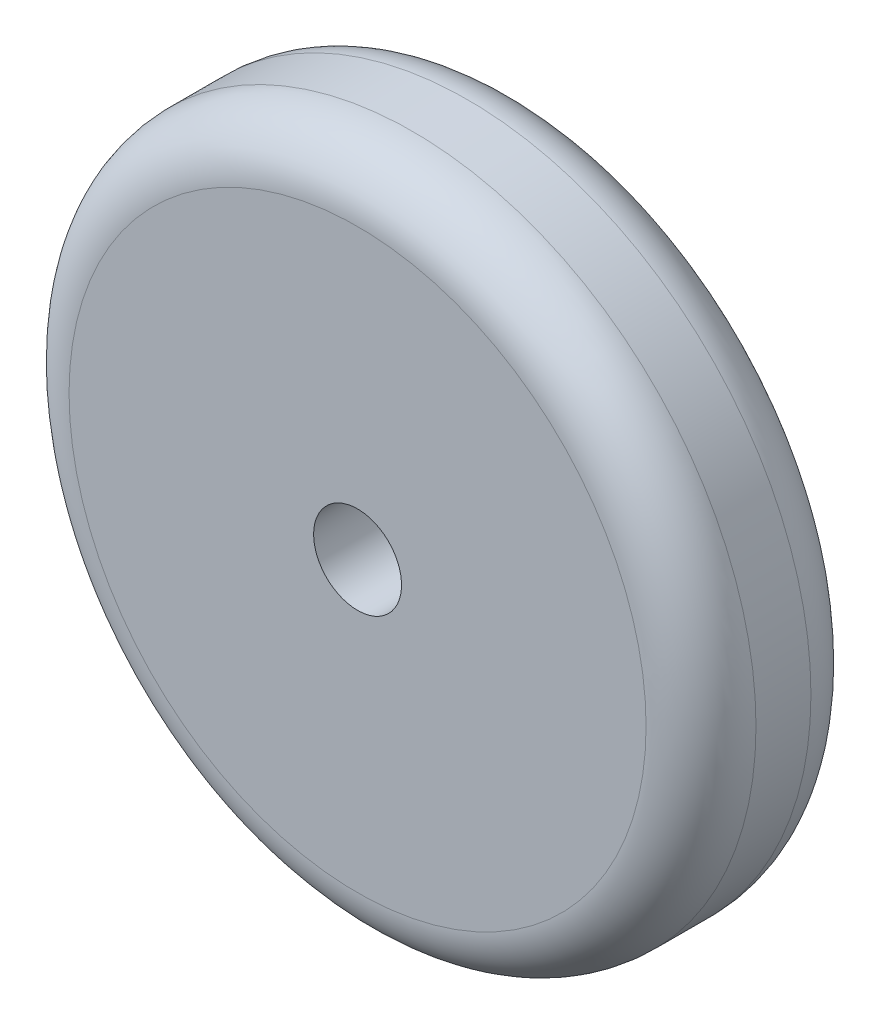
ISO-10303-21;
HEADER;
FILE_DESCRIPTION(('STEP AP214'),'2;1');
FILE_NAME('part.step','',(''),(''),'','','');
FILE_SCHEMA(('AUTOMOTIVE_DESIGN { 1 0 10303 214 1 1 1 1 }'));
ENDSEC;
DATA;
#1=APPLICATION_CONTEXT('core data for automotive mechanical design processes');
#2=APPLICATION_PROTOCOL_DEFINITION('international standard','automotive_design',2000,#1);
#3=PRODUCT_CONTEXT('',#1,'mechanical');
#4=PRODUCT('Part','Part','',(#3));
#5=PRODUCT_RELATED_PRODUCT_CATEGORY('part','',(#4));
#6=PRODUCT_DEFINITION_FORMATION('','',#4);
#7=PRODUCT_DEFINITION_CONTEXT('part definition',#1,'design');
#8=PRODUCT_DEFINITION('design','',#6,#7);
#9=PRODUCT_DEFINITION_SHAPE('','',#8);
#10=(LENGTH_UNIT() NAMED_UNIT(*) SI_UNIT(.MILLI.,.METRE.));
#11=(NAMED_UNIT(*) PLANE_ANGLE_UNIT() SI_UNIT($,.RADIAN.));
#12=(NAMED_UNIT(*) SI_UNIT($,.STERADIAN.) SOLID_ANGLE_UNIT());
#13=UNCERTAINTY_MEASURE_WITH_UNIT(LENGTH_MEASURE(1.E-05),#10,'distance_accuracy_value','');
#14=(GEOMETRIC_REPRESENTATION_CONTEXT(3) GLOBAL_UNCERTAINTY_ASSIGNED_CONTEXT((#13)) GLOBAL_UNIT_ASSIGNED_CONTEXT((#10,
#11,#12)) REPRESENTATION_CONTEXT('',''));
#15=CARTESIAN_POINT('',(0.,0.,0.));
#16=DIRECTION('',(0.,0.,1.));
#17=DIRECTION('',(1.,0.,0.));
#18=AXIS2_PLACEMENT_3D('',#15,#16,#17);
#19=CARTESIAN_POINT('',(0.,0.,30.));
#20=DIRECTION('',(0.,0.,-1.));
#21=DIRECTION('',(-1.,0.,0.));
#22=AXIS2_PLACEMENT_3D('',#19,#20,#21);
#23=CYLINDRICAL_SURFACE('',#22,62.5);
#24=CARTESIAN_POINT('',(0.,0.,10.));
#25=DIRECTION('',(0.,0.,1.));
#26=DIRECTION('',(1.,0.,0.));
#27=AXIS2_PLACEMENT_3D('',#24,#25,#26);
#28=CIRCLE('',#27,62.5);
#29=CARTESIAN_POINT('',(62.5,0.,10.));
#30=VERTEX_POINT('',#29);
#31=EDGE_CURVE('E45',#30,#30,#28,.T.);
#32=ORIENTED_EDGE('',*,*,#31,.T.);
#33=EDGE_LOOP('',(#32));
#34=FACE_BOUND('',#33,.T.);
#35=CARTESIAN_POINT('',(0.,0.,20.));
#36=DIRECTION('',(0.,0.,1.));
#37=DIRECTION('',(1.,0.,0.));
#38=AXIS2_PLACEMENT_3D('',#35,#36,#37);
#39=CIRCLE('',#38,62.5);
#40=CARTESIAN_POINT('',(62.5,0.,20.));
#41=VERTEX_POINT('',#40);
#42=EDGE_CURVE('E49',#41,#41,#39,.F.);
#43=ORIENTED_EDGE('',*,*,#42,.T.);
#44=EDGE_LOOP('',(#43));
#45=FACE_BOUND('',#44,.T.);
#46=ADVANCED_FACE('F34',(#34,#45),#23,.T.);
#47=CARTESIAN_POINT('',(0.,0.,30.));
#48=DIRECTION('',(0.,0.,1.));
#49=DIRECTION('',(1.,0.,0.));
#50=AXIS2_PLACEMENT_3D('',#47,#48,#49);
#51=PLANE('',#50);
#52=CARTESIAN_POINT('',(0.,0.,30.));
#53=DIRECTION('',(0.,0.,-1.));
#54=DIRECTION('',(-1.,0.,0.));
#55=AXIS2_PLACEMENT_3D('',#52,#53,#54);
#56=CIRCLE('',#55,8.);
#57=CARTESIAN_POINT('',(-8.,0.,30.));
#58=VERTEX_POINT('',#57);
#59=EDGE_CURVE('E54',#58,#58,#56,.T.);
#60=ORIENTED_EDGE('',*,*,#59,.T.);
#61=EDGE_LOOP('',(#60));
#62=FACE_BOUND('',#61,.T.);
#63=CARTESIAN_POINT('',(0.,0.,30.));
#64=DIRECTION('',(0.,0.,1.));
#65=DIRECTION('',(1.,0.,0.));
#66=AXIS2_PLACEMENT_3D('',#63,#64,#65);
#67=CIRCLE('',#66,52.5);
#68=CARTESIAN_POINT('',(52.5,0.,30.));
#69=VERTEX_POINT('',#68);
#70=EDGE_CURVE('E10',#69,#69,#67,.T.);
#71=ORIENTED_EDGE('',*,*,#70,.T.);
#72=EDGE_LOOP('',(#71));
#73=FACE_BOUND('',#72,.T.);
#74=ADVANCED_FACE('F61',(#62,#73),#51,.T.);
#75=CARTESIAN_POINT('',(0.,0.,0.));
#76=DIRECTION('',(0.,0.,1.));
#77=DIRECTION('',(1.,0.,0.));
#78=AXIS2_PLACEMENT_3D('',#75,#76,#77);
#79=PLANE('',#78);
#80=CARTESIAN_POINT('',(0.,0.,0.));
#81=DIRECTION('',(0.,0.,-1.));
#82=DIRECTION('',(-1.,0.,0.));
#83=AXIS2_PLACEMENT_3D('',#80,#81,#82);
#84=CIRCLE('',#83,8.);
#85=CARTESIAN_POINT('',(-8.,0.,0.));
#86=VERTEX_POINT('',#85);
#87=EDGE_CURVE('E55',#86,#86,#84,.T.);
#88=ORIENTED_EDGE('',*,*,#87,.F.);
#89=EDGE_LOOP('',(#88));
#90=FACE_BOUND('',#89,.T.);
#91=CARTESIAN_POINT('',(0.,0.,0.));
#92=DIRECTION('',(0.,0.,1.));
#93=DIRECTION('',(1.,0.,0.));
#94=AXIS2_PLACEMENT_3D('',#91,#92,#93);
#95=CIRCLE('',#94,52.5);
#96=CARTESIAN_POINT('',(52.5,0.,0.));
#97=VERTEX_POINT('',#96);
#98=EDGE_CURVE('E41',#97,#97,#95,.F.);
#99=ORIENTED_EDGE('',*,*,#98,.T.);
#100=EDGE_LOOP('',(#99));
#101=FACE_BOUND('',#100,.T.);
#102=ADVANCED_FACE('F69',(#90,#101),#79,.F.);
#103=CARTESIAN_POINT('',(0.,0.,10.));
#104=DIRECTION('',(0.,0.,1.));
#105=DIRECTION('',(1.,0.,0.));
#106=AXIS2_PLACEMENT_3D('',#103,#104,#105);
#107=TOROIDAL_SURFACE('',#106,52.5,10.);
#108=ORIENTED_EDGE('',*,*,#98,.F.);
#109=EDGE_LOOP('',(#108));
#110=FACE_BOUND('',#109,.T.);
#111=ORIENTED_EDGE('',*,*,#31,.F.);
#112=EDGE_LOOP('',(#111));
#113=FACE_BOUND('',#112,.T.);
#114=ADVANCED_FACE('F71',(#110,#113),#107,.T.);
#115=CARTESIAN_POINT('',(0.,0.,20.));
#116=DIRECTION('',(0.,0.,1.));
#117=DIRECTION('',(1.,0.,0.));
#118=AXIS2_PLACEMENT_3D('',#115,#116,#117);
#119=TOROIDAL_SURFACE('',#118,52.5,10.);
#120=ORIENTED_EDGE('',*,*,#42,.F.);
#121=EDGE_LOOP('',(#120));
#122=FACE_BOUND('',#121,.T.);
#123=ORIENTED_EDGE('',*,*,#70,.F.);
#124=EDGE_LOOP('',(#123));
#125=FACE_BOUND('',#124,.T.);
#126=ADVANCED_FACE('F36',(#122,#125),#119,.T.);
#127=CARTESIAN_POINT('',(0.,0.,30.));
#128=DIRECTION('',(0.,0.,-1.));
#129=DIRECTION('',(-1.,0.,0.));
#130=AXIS2_PLACEMENT_3D('',#127,#128,#129);
#131=CYLINDRICAL_SURFACE('',#130,8.);
#132=ORIENTED_EDGE('',*,*,#59,.F.);
#133=EDGE_LOOP('',(#132));
#134=FACE_BOUND('',#133,.T.);
#135=ORIENTED_EDGE('',*,*,#87,.T.);
#136=EDGE_LOOP('',(#135));
#137=FACE_BOUND('',#136,.T.);
#138=ADVANCED_FACE('F63',(#134,#137),#131,.F.);
#139=CLOSED_SHELL('',(#46,#74,#102,#114,#126,#138));
#140=MANIFOLD_SOLID_BREP('B2',#139);
#141=ADVANCED_BREP_SHAPE_REPRESENTATION('',(#18,#140),#14);
#142=SHAPE_DEFINITION_REPRESENTATION(#9,#141);
ENDSEC;
END-ISO-10303-21;
